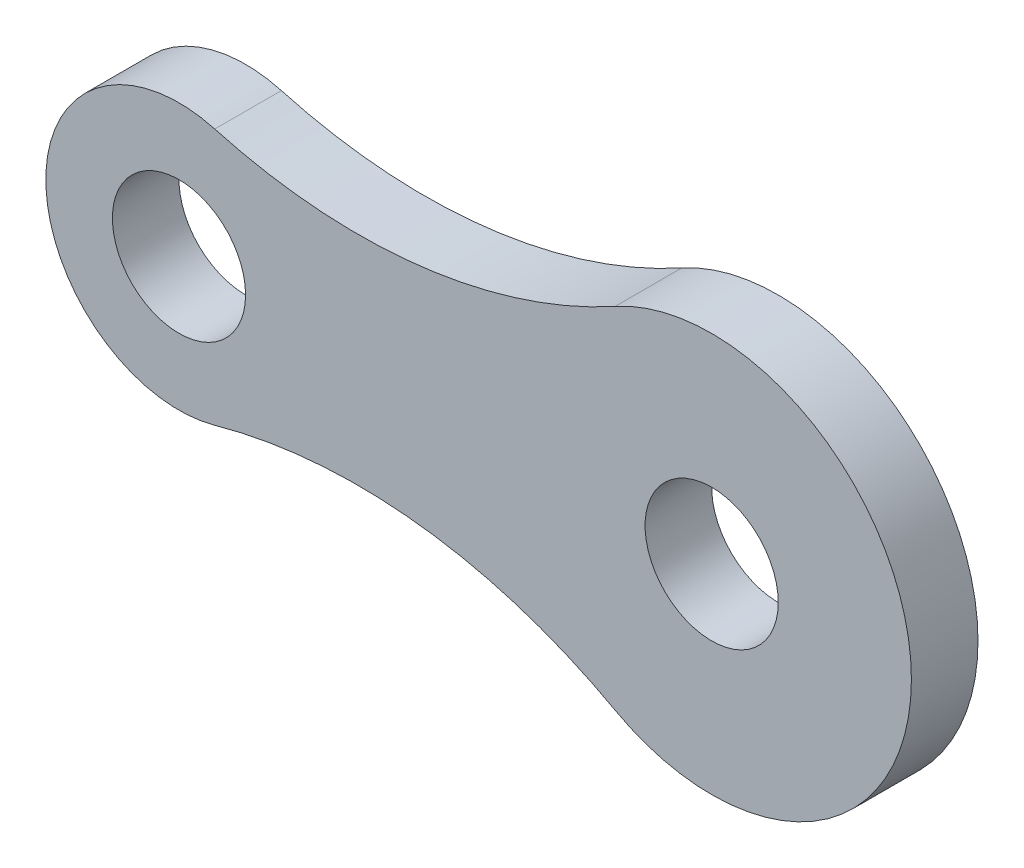
ISO-10303-21;
HEADER;
FILE_DESCRIPTION(('STEP AP214'),'2;1');
FILE_NAME('part.step','',(''),(''),'','','');
FILE_SCHEMA(('AUTOMOTIVE_DESIGN { 1 0 10303 214 1 1 1 1 }'));
ENDSEC;
DATA;
#1=APPLICATION_CONTEXT('core data for automotive mechanical design processes');
#2=APPLICATION_PROTOCOL_DEFINITION('international standard','automotive_design',2000,#1);
#3=PRODUCT_CONTEXT('',#1,'mechanical');
#4=PRODUCT('Part','Part','',(#3));
#5=PRODUCT_RELATED_PRODUCT_CATEGORY('part','',(#4));
#6=PRODUCT_DEFINITION_FORMATION('','',#4);
#7=PRODUCT_DEFINITION_CONTEXT('part definition',#1,'design');
#8=PRODUCT_DEFINITION('design','',#6,#7);
#9=PRODUCT_DEFINITION_SHAPE('','',#8);
#10=(LENGTH_UNIT() NAMED_UNIT(*) SI_UNIT(.MILLI.,.METRE.));
#11=(NAMED_UNIT(*) PLANE_ANGLE_UNIT() SI_UNIT($,.RADIAN.));
#12=(NAMED_UNIT(*) SI_UNIT($,.STERADIAN.) SOLID_ANGLE_UNIT());
#13=UNCERTAINTY_MEASURE_WITH_UNIT(LENGTH_MEASURE(1.E-05),#10,'distance_accuracy_value','');
#14=(GEOMETRIC_REPRESENTATION_CONTEXT(3) GLOBAL_UNCERTAINTY_ASSIGNED_CONTEXT((#13)) GLOBAL_UNIT_ASSIGNED_CONTEXT((#10,
#11,#12)) REPRESENTATION_CONTEXT('',''));
#15=CARTESIAN_POINT('',(0.,0.,0.));
#16=DIRECTION('',(0.,0.,1.));
#17=DIRECTION('',(1.,0.,0.));
#18=AXIS2_PLACEMENT_3D('',#15,#16,#17);
#19=CARTESIAN_POINT('',(17.065625,-61.1638328046843,12.7));
#20=DIRECTION('',(0.,0.,1.));
#21=DIRECTION('',(1.,0.,0.));
#22=AXIS2_PLACEMENT_3D('',#19,#20,#21);
#23=PLANE('',#22);
#24=CARTESIAN_POINT('',(0.,0.,12.7));
#25=DIRECTION('',(0.,0.,1.));
#26=DIRECTION('',(1.,0.,0.));
#27=AXIS2_PLACEMENT_3D('',#24,#25,#26);
#28=CIRCLE('',#27,12.7);
#29=CARTESIAN_POINT('',(12.7,0.,12.7));
#30=VERTEX_POINT('',#29);
#31=EDGE_CURVE('E100',#30,#30,#28,.T.);
#32=ORIENTED_EDGE('',*,*,#31,.F.);
#33=EDGE_LOOP('',(#32));
#34=FACE_BOUND('',#33,.T.);
#35=CARTESIAN_POINT('',(34.13125,-122.327665609369,12.7));
#36=DIRECTION('',(0.,0.,-1.));
#37=DIRECTION('',(1.,0.,0.));
#38=AXIS2_PLACEMENT_3D('',#35,#36,#37);
#39=CIRCLE('',#38,101.6);
#40=CARTESIAN_POINT('',(6.82624999999999,-24.4655331218737,12.7));
#41=VERTEX_POINT('',#40);
#42=CARTESIAN_POINT('',(83.1994318181818,-33.3620906207369,12.7));
#43=VERTEX_POINT('',#42);
#44=EDGE_CURVE('E85',#41,#43,#39,.T.);
#45=ORIENTED_EDGE('',*,*,#44,.T.);
#46=CARTESIAN_POINT('',(101.6,0.,12.7));
#47=DIRECTION('',(0.,0.,1.));
#48=DIRECTION('',(1.,0.,0.));
#49=AXIS2_PLACEMENT_3D('',#46,#47,#48);
#50=CIRCLE('',#49,38.1);
#51=CARTESIAN_POINT('',(83.1994318181818,33.3620906207369,12.7));
#52=VERTEX_POINT('',#51);
#53=EDGE_CURVE('E80',#43,#52,#50,.T.);
#54=ORIENTED_EDGE('',*,*,#53,.T.);
#55=CARTESIAN_POINT('',(34.13125,122.327665609369,12.7));
#56=DIRECTION('',(0.,0.,-1.));
#57=DIRECTION('',(1.,0.,0.));
#58=AXIS2_PLACEMENT_3D('',#55,#56,#57);
#59=CIRCLE('',#58,101.6);
#60=CARTESIAN_POINT('',(6.82625000000001,24.4655331218737,12.7));
#61=VERTEX_POINT('',#60);
#62=EDGE_CURVE('E83',#52,#61,#59,.T.);
#63=ORIENTED_EDGE('',*,*,#62,.T.);
#64=CARTESIAN_POINT('',(0.,0.,12.7));
#65=DIRECTION('',(0.,0.,1.));
#66=DIRECTION('',(1.,0.,0.));
#67=AXIS2_PLACEMENT_3D('',#64,#65,#66);
#68=CIRCLE('',#67,25.4);
#69=EDGE_CURVE('E50',#61,#41,#68,.T.);
#70=ORIENTED_EDGE('',*,*,#69,.T.);
#71=EDGE_LOOP('',(#45,#54,#63,#70));
#72=FACE_BOUND('',#71,.T.);
#73=CARTESIAN_POINT('',(101.6,0.,12.7));
#74=DIRECTION('',(0.,0.,1.));
#75=DIRECTION('',(1.,0.,0.));
#76=AXIS2_PLACEMENT_3D('',#73,#74,#75);
#77=CIRCLE('',#76,12.7);
#78=CARTESIAN_POINT('',(114.3,0.,12.7));
#79=VERTEX_POINT('',#78);
#80=EDGE_CURVE('E115',#79,#79,#77,.T.);
#81=ORIENTED_EDGE('',*,*,#80,.F.);
#82=EDGE_LOOP('',(#81));
#83=FACE_BOUND('',#82,.T.);
#84=ADVANCED_FACE('F33',(#34,#72,#83),#23,.T.);
#85=CARTESIAN_POINT('',(17.065625,-61.1638328046843,0.));
#86=DIRECTION('',(0.,0.,1.));
#87=DIRECTION('',(1.,0.,0.));
#88=AXIS2_PLACEMENT_3D('',#85,#86,#87);
#89=PLANE('',#88);
#90=CARTESIAN_POINT('',(34.13125,-122.327665609369,0.));
#91=DIRECTION('',(0.,0.,-1.));
#92=DIRECTION('',(1.,0.,0.));
#93=AXIS2_PLACEMENT_3D('',#90,#91,#92);
#94=CIRCLE('',#93,101.6);
#95=CARTESIAN_POINT('',(6.82624999999999,-24.4655331218737,0.));
#96=VERTEX_POINT('',#95);
#97=CARTESIAN_POINT('',(83.1994318181818,-33.3620906207369,0.));
#98=VERTEX_POINT('',#97);
#99=EDGE_CURVE('E97',#96,#98,#94,.T.);
#100=ORIENTED_EDGE('',*,*,#99,.F.);
#101=CARTESIAN_POINT('',(0.,0.,0.));
#102=DIRECTION('',(0.,0.,1.));
#103=DIRECTION('',(1.,0.,0.));
#104=AXIS2_PLACEMENT_3D('',#101,#102,#103);
#105=CIRCLE('',#104,25.4);
#106=CARTESIAN_POINT('',(6.82625000000001,24.4655331218737,0.));
#107=VERTEX_POINT('',#106);
#108=EDGE_CURVE('E73',#107,#96,#105,.T.);
#109=ORIENTED_EDGE('',*,*,#108,.F.);
#110=CARTESIAN_POINT('',(34.13125,122.327665609369,0.));
#111=DIRECTION('',(0.,0.,-1.));
#112=DIRECTION('',(1.,0.,0.));
#113=AXIS2_PLACEMENT_3D('',#110,#111,#112);
#114=CIRCLE('',#113,101.6);
#115=CARTESIAN_POINT('',(83.1994318181818,33.3620906207369,0.));
#116=VERTEX_POINT('',#115);
#117=EDGE_CURVE('E67',#116,#107,#114,.T.);
#118=ORIENTED_EDGE('',*,*,#117,.F.);
#119=CARTESIAN_POINT('',(101.6,0.,0.));
#120=DIRECTION('',(0.,0.,1.));
#121=DIRECTION('',(1.,0.,0.));
#122=AXIS2_PLACEMENT_3D('',#119,#120,#121);
#123=CIRCLE('',#122,38.1);
#124=EDGE_CURVE('E89',#98,#116,#123,.T.);
#125=ORIENTED_EDGE('',*,*,#124,.F.);
#126=EDGE_LOOP('',(#100,#109,#118,#125));
#127=FACE_BOUND('',#126,.T.);
#128=CARTESIAN_POINT('',(0.,0.,0.));
#129=DIRECTION('',(0.,0.,1.));
#130=DIRECTION('',(1.,0.,0.));
#131=AXIS2_PLACEMENT_3D('',#128,#129,#130);
#132=CIRCLE('',#131,12.7);
#133=CARTESIAN_POINT('',(12.7,0.,0.));
#134=VERTEX_POINT('',#133);
#135=EDGE_CURVE('E112',#134,#134,#132,.T.);
#136=ORIENTED_EDGE('',*,*,#135,.T.);
#137=EDGE_LOOP('',(#136));
#138=FACE_BOUND('',#137,.T.);
#139=CARTESIAN_POINT('',(101.6,0.,0.));
#140=DIRECTION('',(0.,0.,1.));
#141=DIRECTION('',(1.,0.,0.));
#142=AXIS2_PLACEMENT_3D('',#139,#140,#141);
#143=CIRCLE('',#142,12.7);
#144=CARTESIAN_POINT('',(114.3,0.,0.));
#145=VERTEX_POINT('',#144);
#146=EDGE_CURVE('E118',#145,#145,#143,.T.);
#147=ORIENTED_EDGE('',*,*,#146,.T.);
#148=EDGE_LOOP('',(#147));
#149=FACE_BOUND('',#148,.T.);
#150=ADVANCED_FACE('F108',(#127,#138,#149),#89,.F.);
#151=CARTESIAN_POINT('',(34.13125,-122.327665609369,12.7));
#152=DIRECTION('',(0.,0.,-1.));
#153=DIRECTION('',(-1.,0.,0.));
#154=AXIS2_PLACEMENT_3D('',#151,#152,#153);
#155=CYLINDRICAL_SURFACE('',#154,101.6);
#156=ORIENTED_EDGE('',*,*,#99,.T.);
#157=DIRECTION('',(0.,0.,-1.));
#158=VECTOR('',#157,1.);
#159=CARTESIAN_POINT('',(83.1994318181818,-33.3620906207369,12.7));
#160=LINE('',#159,#158);
#161=EDGE_CURVE('E11',#43,#98,#160,.T.);
#162=ORIENTED_EDGE('',*,*,#161,.F.);
#163=ORIENTED_EDGE('',*,*,#44,.F.);
#164=DIRECTION('',(0.,0.,-1.));
#165=VECTOR('',#164,1.);
#166=CARTESIAN_POINT('',(6.82624999999999,-24.4655331218737,12.7));
#167=LINE('',#166,#165);
#168=EDGE_CURVE('E93',#41,#96,#167,.T.);
#169=ORIENTED_EDGE('',*,*,#168,.T.);
#170=EDGE_LOOP('',(#156,#162,#163,#169));
#171=FACE_BOUND('',#170,.T.);
#172=ADVANCED_FACE('F35',(#171),#155,.F.);
#173=CARTESIAN_POINT('',(101.6,0.,12.7));
#174=DIRECTION('',(0.,0.,-1.));
#175=DIRECTION('',(-1.,0.,0.));
#176=AXIS2_PLACEMENT_3D('',#173,#174,#175);
#177=CYLINDRICAL_SURFACE('',#176,38.1);
#178=ORIENTED_EDGE('',*,*,#124,.T.);
#179=DIRECTION('',(0.,0.,-1.));
#180=VECTOR('',#179,1.);
#181=CARTESIAN_POINT('',(83.1994318181818,33.3620906207369,12.7));
#182=LINE('',#181,#180);
#183=EDGE_CURVE('E42',#52,#116,#182,.T.);
#184=ORIENTED_EDGE('',*,*,#183,.F.);
#185=ORIENTED_EDGE('',*,*,#53,.F.);
#186=ORIENTED_EDGE('',*,*,#161,.T.);
#187=EDGE_LOOP('',(#178,#184,#185,#186));
#188=FACE_BOUND('',#187,.T.);
#189=ADVANCED_FACE('F88',(#188),#177,.T.);
#190=CARTESIAN_POINT('',(34.13125,122.327665609369,12.7));
#191=DIRECTION('',(0.,0.,-1.));
#192=DIRECTION('',(-1.,0.,0.));
#193=AXIS2_PLACEMENT_3D('',#190,#191,#192);
#194=CYLINDRICAL_SURFACE('',#193,101.6);
#195=ORIENTED_EDGE('',*,*,#117,.T.);
#196=DIRECTION('',(0.,0.,-1.));
#197=VECTOR('',#196,1.);
#198=CARTESIAN_POINT('',(6.82625000000001,24.4655331218737,12.7));
#199=LINE('',#198,#197);
#200=EDGE_CURVE('E90',#61,#107,#199,.T.);
#201=ORIENTED_EDGE('',*,*,#200,.F.);
#202=ORIENTED_EDGE('',*,*,#62,.F.);
#203=ORIENTED_EDGE('',*,*,#183,.T.);
#204=EDGE_LOOP('',(#195,#201,#202,#203));
#205=FACE_BOUND('',#204,.T.);
#206=ADVANCED_FACE('F91',(#205),#194,.F.);
#207=CARTESIAN_POINT('',(0.,0.,12.7));
#208=DIRECTION('',(0.,0.,-1.));
#209=DIRECTION('',(-1.,0.,0.));
#210=AXIS2_PLACEMENT_3D('',#207,#208,#209);
#211=CYLINDRICAL_SURFACE('',#210,25.4);
#212=ORIENTED_EDGE('',*,*,#108,.T.);
#213=ORIENTED_EDGE('',*,*,#168,.F.);
#214=ORIENTED_EDGE('',*,*,#69,.F.);
#215=ORIENTED_EDGE('',*,*,#200,.T.);
#216=EDGE_LOOP('',(#212,#213,#214,#215));
#217=FACE_BOUND('',#216,.T.);
#218=ADVANCED_FACE('F105',(#217),#211,.T.);
#219=CARTESIAN_POINT('',(0.,0.,12.7));
#220=DIRECTION('',(0.,0.,-1.));
#221=DIRECTION('',(-1.,0.,0.));
#222=AXIS2_PLACEMENT_3D('',#219,#220,#221);
#223=CYLINDRICAL_SURFACE('',#222,12.7);
#224=ORIENTED_EDGE('',*,*,#31,.T.);
#225=EDGE_LOOP('',(#224));
#226=FACE_BOUND('',#225,.T.);
#227=ORIENTED_EDGE('',*,*,#135,.F.);
#228=EDGE_LOOP('',(#227));
#229=FACE_BOUND('',#228,.T.);
#230=ADVANCED_FACE('F135',(#226,#229),#223,.F.);
#231=CARTESIAN_POINT('',(101.6,0.,12.7));
#232=DIRECTION('',(0.,0.,-1.));
#233=DIRECTION('',(-1.,0.,0.));
#234=AXIS2_PLACEMENT_3D('',#231,#232,#233);
#235=CYLINDRICAL_SURFACE('',#234,12.7);
#236=ORIENTED_EDGE('',*,*,#80,.T.);
#237=EDGE_LOOP('',(#236));
#238=FACE_BOUND('',#237,.T.);
#239=ORIENTED_EDGE('',*,*,#146,.F.);
#240=EDGE_LOOP('',(#239));
#241=FACE_BOUND('',#240,.T.);
#242=ADVANCED_FACE('F124',(#238,#241),#235,.F.);
#243=CLOSED_SHELL('',(#84,#150,#172,#189,#206,#218,#230,#242));
#244=MANIFOLD_SOLID_BREP('B2',#243);
#245=ADVANCED_BREP_SHAPE_REPRESENTATION('',(#18,#244),#14);
#246=SHAPE_DEFINITION_REPRESENTATION(#9,#245);
ENDSEC;
END-ISO-10303-21;
